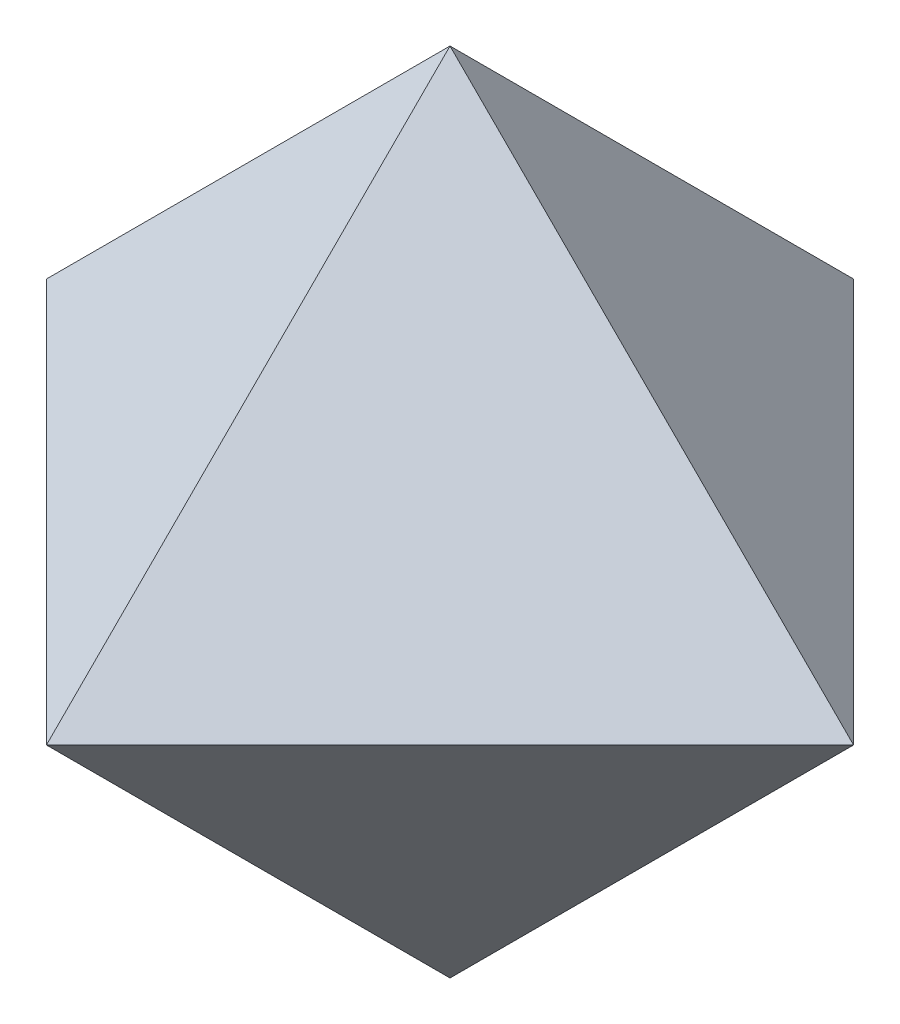
ISO-10303-21;
HEADER;
FILE_DESCRIPTION(('STEP AP214'),'2;1');
FILE_NAME('part.step','',(''),(''),'','','');
FILE_SCHEMA(('AUTOMOTIVE_DESIGN { 1 0 10303 214 1 1 1 1 }'));
ENDSEC;
DATA;
#1=APPLICATION_CONTEXT('core data for automotive mechanical design processes');
#2=APPLICATION_PROTOCOL_DEFINITION('international standard','automotive_design',2000,#1);
#3=PRODUCT_CONTEXT('',#1,'mechanical');
#4=PRODUCT('Part','Part','',(#3));
#5=PRODUCT_RELATED_PRODUCT_CATEGORY('part','',(#4));
#6=PRODUCT_DEFINITION_FORMATION('','',#4);
#7=PRODUCT_DEFINITION_CONTEXT('part definition',#1,'design');
#8=PRODUCT_DEFINITION('design','',#6,#7);
#9=PRODUCT_DEFINITION_SHAPE('','',#8);
#10=(LENGTH_UNIT() NAMED_UNIT(*) SI_UNIT(.MILLI.,.METRE.));
#11=(NAMED_UNIT(*) PLANE_ANGLE_UNIT() SI_UNIT($,.RADIAN.));
#12=(NAMED_UNIT(*) SI_UNIT($,.STERADIAN.) SOLID_ANGLE_UNIT());
#13=UNCERTAINTY_MEASURE_WITH_UNIT(LENGTH_MEASURE(1.E-05),#10,'distance_accuracy_value','');
#14=(GEOMETRIC_REPRESENTATION_CONTEXT(3) GLOBAL_UNCERTAINTY_ASSIGNED_CONTEXT((#13)) GLOBAL_UNIT_ASSIGNED_CONTEXT((#10,
#11,#12)) REPRESENTATION_CONTEXT('',''));
#15=CARTESIAN_POINT('',(0.,0.,0.));
#16=DIRECTION('',(0.,0.,1.));
#17=DIRECTION('',(1.,0.,0.));
#18=AXIS2_PLACEMENT_3D('',#15,#16,#17);
#19=CARTESIAN_POINT('',(-16.6666666666663,16.6666666666669,-16.6666666666668));
#20=DIRECTION('',(-0.577350269189614,0.577350269189634,-0.57735026918963));
#21=DIRECTION('',(-0.707106781186552,0.,0.707106781186543));
#22=AXIS2_PLACEMENT_3D('',#19,#20,#21);
#23=PLANE('',#22);
#24=DIRECTION('',(-0.707106781186552,0.,0.707106781186543));
#25=VECTOR('',#24,1.);
#26=CARTESIAN_POINT('',(3.49148133884313E-13,0.,-50.));
#27=LINE('',#26,#25);
#28=CARTESIAN_POINT('',(3.49148133884313E-13,0.,-50.));
#29=VERTEX_POINT('',#28);
#30=CARTESIAN_POINT('',(-50.,0.,0.));
#31=VERTEX_POINT('',#30);
#32=EDGE_CURVE('E180',#29,#31,#27,.T.);
#33=ORIENTED_EDGE('',*,*,#32,.T.);
#34=DIRECTION('',(-0.707106781186547,-0.707106781186547,0.));
#35=VECTOR('',#34,1.);
#36=CARTESIAN_POINT('',(0.,50.,0.));
#37=LINE('',#36,#35);
#38=CARTESIAN_POINT('',(6.98296267768627E-13,50.,0.));
#39=VERTEX_POINT('',#38);
#40=EDGE_CURVE('E98',#39,#31,#37,.T.);
#41=ORIENTED_EDGE('',*,*,#40,.F.);
#42=DIRECTION('',(0.,0.707106781186547,0.707106781186547));
#43=VECTOR('',#42,1.);
#44=CARTESIAN_POINT('',(3.49148133884313E-13,0.,-50.));
#45=LINE('',#44,#43);
#46=EDGE_CURVE('E97',#29,#39,#45,.T.);
#47=ORIENTED_EDGE('',*,*,#46,.F.);
#48=EDGE_LOOP('',(#33,#41,#47));
#49=FACE_BOUND('',#48,.T.);
#50=ADVANCED_FACE('F41',(#49),#23,.T.);
#51=CARTESIAN_POINT('',(16.666666666667,16.6666666666664,-16.6666666666665));
#52=DIRECTION('',(0.577350269189638,0.577350269189618,-0.577350269189622));
#53=DIRECTION('',(-0.707106781186543,0.,-0.707106781186552));
#54=AXIS2_PLACEMENT_3D('',#51,#52,#53);
#55=PLANE('',#54);
#56=ORIENTED_EDGE('',*,*,#46,.T.);
#57=DIRECTION('',(-0.707106781186547,0.707106781186547,0.));
#58=VECTOR('',#57,1.);
#59=CARTESIAN_POINT('',(50.,0.,0.));
#60=LINE('',#59,#58);
#61=CARTESIAN_POINT('',(50.,0.,0.));
#62=VERTEX_POINT('',#61);
#63=EDGE_CURVE('E84',#62,#39,#60,.T.);
#64=ORIENTED_EDGE('',*,*,#63,.F.);
#65=DIRECTION('',(0.707106781186543,0.,0.707106781186552));
#66=VECTOR('',#65,1.);
#67=CARTESIAN_POINT('',(3.49148133884313E-13,0.,-50.));
#68=LINE('',#67,#66);
#69=EDGE_CURVE('E12',#29,#62,#68,.T.);
#70=ORIENTED_EDGE('',*,*,#69,.F.);
#71=EDGE_LOOP('',(#56,#64,#70));
#72=FACE_BOUND('',#71,.T.);
#73=ADVANCED_FACE('F95',(#72),#55,.T.);
#74=CARTESIAN_POINT('',(-16.6666666666668,-16.6666666666664,-16.6666666666668));
#75=DIRECTION('',(-0.57735026918963,-0.577350269189618,-0.57735026918963));
#76=DIRECTION('',(-0.707106781186552,0.,0.707106781186543));
#77=AXIS2_PLACEMENT_3D('',#74,#75,#76);
#78=PLANE('',#77);
#79=DIRECTION('',(0.,-0.707106781186547,0.707106781186547));
#80=VECTOR('',#79,1.);
#81=CARTESIAN_POINT('',(3.49148133884313E-13,0.,-50.));
#82=LINE('',#81,#80);
#83=CARTESIAN_POINT('',(0.,-50.,0.));
#84=VERTEX_POINT('',#83);
#85=EDGE_CURVE('E50',#29,#84,#82,.T.);
#86=ORIENTED_EDGE('',*,*,#85,.T.);
#87=DIRECTION('',(0.707106781186547,-0.707106781186547,0.));
#88=VECTOR('',#87,1.);
#89=CARTESIAN_POINT('',(-50.,0.,0.));
#90=LINE('',#89,#88);
#91=EDGE_CURVE('E90',#31,#84,#90,.T.);
#92=ORIENTED_EDGE('',*,*,#91,.F.);
#93=ORIENTED_EDGE('',*,*,#32,.F.);
#94=EDGE_LOOP('',(#86,#92,#93));
#95=FACE_BOUND('',#94,.T.);
#96=ADVANCED_FACE('F101',(#95),#78,.T.);
#97=CARTESIAN_POINT('',(16.6666666666666,-16.6666666666669,-16.6666666666665));
#98=DIRECTION('',(0.577350269189622,-0.577350269189634,-0.577350269189622));
#99=DIRECTION('',(-0.707106781186557,-0.707106781186538,0.));
#100=AXIS2_PLACEMENT_3D('',#97,#98,#99);
#101=PLANE('',#100);
#102=ORIENTED_EDGE('',*,*,#69,.T.);
#103=DIRECTION('',(0.707106781186547,0.707106781186547,0.));
#104=VECTOR('',#103,1.);
#105=CARTESIAN_POINT('',(0.,-50.,0.));
#106=LINE('',#105,#104);
#107=EDGE_CURVE('E78',#84,#62,#106,.T.);
#108=ORIENTED_EDGE('',*,*,#107,.F.);
#109=ORIENTED_EDGE('',*,*,#85,.F.);
#110=EDGE_LOOP('',(#102,#108,#109));
#111=FACE_BOUND('',#110,.T.);
#112=ADVANCED_FACE('F43',(#111),#101,.T.);
#113=CARTESIAN_POINT('',(16.6666666666667,16.6666666666667,16.6666666666667));
#114=DIRECTION('',(0.577350269189626,0.577350269189626,0.577350269189626));
#115=DIRECTION('',(0.707106781186547,0.,-0.707106781186547));
#116=AXIS2_PLACEMENT_3D('',#113,#114,#115);
#117=PLANE('',#116);
#118=DIRECTION('',(0.707106781186547,0.,-0.707106781186547));
#119=VECTOR('',#118,1.);
#120=CARTESIAN_POINT('',(0.,0.,50.));
#121=LINE('',#120,#119);
#122=CARTESIAN_POINT('',(0.,0.,50.));
#123=VERTEX_POINT('',#122);
#124=EDGE_CURVE('E81',#123,#62,#121,.T.);
#125=ORIENTED_EDGE('',*,*,#124,.T.);
#126=ORIENTED_EDGE('',*,*,#63,.T.);
#127=DIRECTION('',(0.,0.707106781186547,-0.707106781186547));
#128=VECTOR('',#127,1.);
#129=CARTESIAN_POINT('',(0.,0.,50.));
#130=LINE('',#129,#128);
#131=EDGE_CURVE('E64',#123,#39,#130,.T.);
#132=ORIENTED_EDGE('',*,*,#131,.F.);
#133=EDGE_LOOP('',(#125,#126,#132));
#134=FACE_BOUND('',#133,.T.);
#135=ADVANCED_FACE('F88',(#134),#117,.T.);
#136=CARTESIAN_POINT('',(-16.6666666666667,16.6666666666667,16.6666666666667));
#137=DIRECTION('',(-0.577350269189626,0.577350269189626,0.577350269189626));
#138=DIRECTION('',(0.707106781186547,0.,0.707106781186547));
#139=AXIS2_PLACEMENT_3D('',#136,#137,#138);
#140=PLANE('',#139);
#141=ORIENTED_EDGE('',*,*,#131,.T.);
#142=ORIENTED_EDGE('',*,*,#40,.T.);
#143=DIRECTION('',(-0.707106781186547,0.,-0.707106781186547));
#144=VECTOR('',#143,1.);
#145=CARTESIAN_POINT('',(0.,0.,50.));
#146=LINE('',#145,#144);
#147=EDGE_CURVE('E178',#123,#31,#146,.T.);
#148=ORIENTED_EDGE('',*,*,#147,.F.);
#149=EDGE_LOOP('',(#141,#142,#148));
#150=FACE_BOUND('',#149,.T.);
#151=ADVANCED_FACE('F106',(#150),#140,.T.);
#152=CARTESIAN_POINT('',(16.6666666666667,-16.6666666666667,16.6666666666667));
#153=DIRECTION('',(0.577350269189626,-0.577350269189626,0.577350269189626));
#154=DIRECTION('',(0.707106781186547,0.,-0.707106781186547));
#155=AXIS2_PLACEMENT_3D('',#152,#153,#154);
#156=PLANE('',#155);
#157=DIRECTION('',(0.,-0.707106781186547,-0.707106781186547));
#158=VECTOR('',#157,1.);
#159=CARTESIAN_POINT('',(0.,0.,50.));
#160=LINE('',#159,#158);
#161=EDGE_CURVE('E82',#123,#84,#160,.T.);
#162=ORIENTED_EDGE('',*,*,#161,.T.);
#163=ORIENTED_EDGE('',*,*,#107,.T.);
#164=ORIENTED_EDGE('',*,*,#124,.F.);
#165=EDGE_LOOP('',(#162,#163,#164));
#166=FACE_BOUND('',#165,.T.);
#167=ADVANCED_FACE('F80',(#166),#156,.T.);
#168=CARTESIAN_POINT('',(-16.6666666666667,-16.6666666666667,16.6666666666667));
#169=DIRECTION('',(-0.577350269189626,-0.577350269189626,0.577350269189626));
#170=DIRECTION('',(0.707106781186548,-0.707106781186548,0.));
#171=AXIS2_PLACEMENT_3D('',#168,#169,#170);
#172=PLANE('',#171);
#173=ORIENTED_EDGE('',*,*,#147,.T.);
#174=ORIENTED_EDGE('',*,*,#91,.T.);
#175=ORIENTED_EDGE('',*,*,#161,.F.);
#176=EDGE_LOOP('',(#173,#174,#175));
#177=FACE_BOUND('',#176,.T.);
#178=ADVANCED_FACE('F118',(#177),#172,.T.);
#179=CLOSED_SHELL('',(#50,#73,#96,#112,#135,#151,#167,#178));
#180=MANIFOLD_SOLID_BREP('B2',#179);
#181=ADVANCED_BREP_SHAPE_REPRESENTATION('',(#18,#180),#14);
#182=SHAPE_DEFINITION_REPRESENTATION(#9,#181);
ENDSEC;
END-ISO-10303-21;
